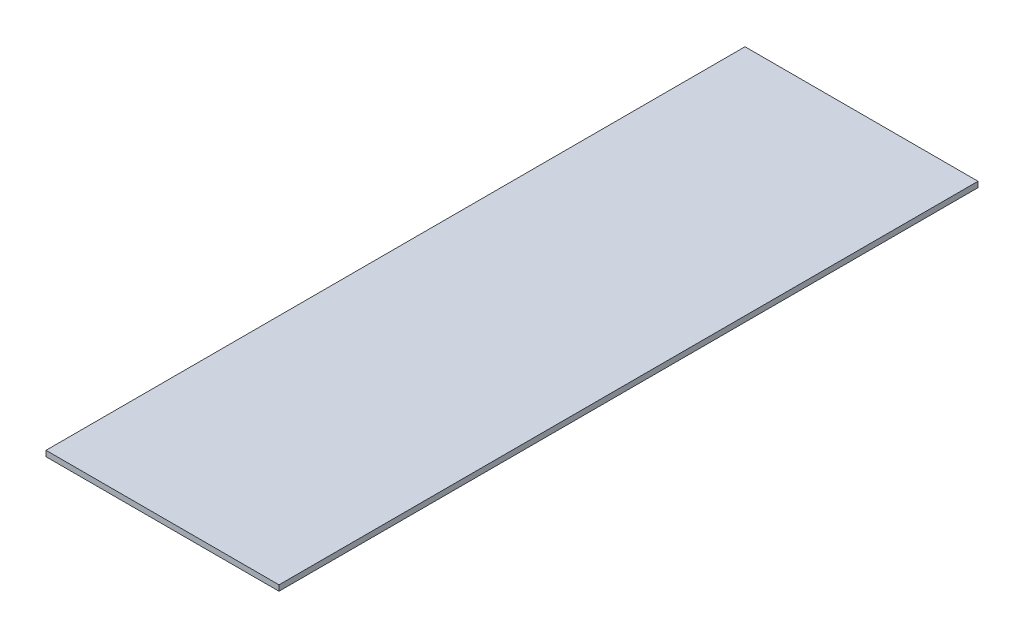
ISO-10303-21;
HEADER;
FILE_DESCRIPTION(('STEP AP214'),'2;1');
FILE_NAME('part.step','',(''),(''),'','','');
FILE_SCHEMA(('AUTOMOTIVE_DESIGN { 1 0 10303 214 1 1 1 1 }'));
ENDSEC;
DATA;
#1=APPLICATION_CONTEXT('core data for automotive mechanical design processes');
#2=APPLICATION_PROTOCOL_DEFINITION('international standard','automotive_design',2000,#1);
#3=PRODUCT_CONTEXT('',#1,'mechanical');
#4=PRODUCT('Part','Part','',(#3));
#5=PRODUCT_RELATED_PRODUCT_CATEGORY('part','',(#4));
#6=PRODUCT_DEFINITION_FORMATION('','',#4);
#7=PRODUCT_DEFINITION_CONTEXT('part definition',#1,'design');
#8=PRODUCT_DEFINITION('design','',#6,#7);
#9=PRODUCT_DEFINITION_SHAPE('','',#8);
#10=(LENGTH_UNIT() NAMED_UNIT(*) SI_UNIT(.MILLI.,.METRE.));
#11=(NAMED_UNIT(*) PLANE_ANGLE_UNIT() SI_UNIT($,.RADIAN.));
#12=(NAMED_UNIT(*) SI_UNIT($,.STERADIAN.) SOLID_ANGLE_UNIT());
#13=UNCERTAINTY_MEASURE_WITH_UNIT(LENGTH_MEASURE(1.E-05),#10,'distance_accuracy_value','');
#14=(GEOMETRIC_REPRESENTATION_CONTEXT(3) GLOBAL_UNCERTAINTY_ASSIGNED_CONTEXT((#13)) GLOBAL_UNIT_ASSIGNED_CONTEXT((#10,
#11,#12)) REPRESENTATION_CONTEXT('',''));
#15=CARTESIAN_POINT('',(0.,0.,0.));
#16=DIRECTION('',(0.,0.,1.));
#17=DIRECTION('',(1.,0.,0.));
#18=AXIS2_PLACEMENT_3D('',#15,#16,#17);
#19=CARTESIAN_POINT('',(2500.,-120.,7500.));
#20=DIRECTION('',(1.,0.,0.));
#21=DIRECTION('',(0.,0.,-1.));
#22=AXIS2_PLACEMENT_3D('',#19,#20,#21);
#23=PLANE('',#22);
#24=DIRECTION('',(0.,0.,-1.));
#25=VECTOR('',#24,1.);
#26=CARTESIAN_POINT('',(2500.,0.,7500.));
#27=LINE('',#26,#25);
#28=CARTESIAN_POINT('',(2500.,0.,7500.));
#29=VERTEX_POINT('',#28);
#30=CARTESIAN_POINT('',(2500.,0.,-7500.));
#31=VERTEX_POINT('',#30);
#32=EDGE_CURVE('E99',#29,#31,#27,.T.);
#33=ORIENTED_EDGE('',*,*,#32,.F.);
#34=DIRECTION('',(0.,1.,0.));
#35=VECTOR('',#34,1.);
#36=CARTESIAN_POINT('',(2500.,-120.,7500.));
#37=LINE('',#36,#35);
#38=CARTESIAN_POINT('',(2500.,-120.,7500.));
#39=VERTEX_POINT('',#38);
#40=EDGE_CURVE('E11',#39,#29,#37,.T.);
#41=ORIENTED_EDGE('',*,*,#40,.F.);
#42=DIRECTION('',(0.,0.,-1.));
#43=VECTOR('',#42,1.);
#44=CARTESIAN_POINT('',(2500.,-120.,7500.));
#45=LINE('',#44,#43);
#46=CARTESIAN_POINT('',(2500.,-120.,-7500.));
#47=VERTEX_POINT('',#46);
#48=EDGE_CURVE('E93',#39,#47,#45,.T.);
#49=ORIENTED_EDGE('',*,*,#48,.T.);
#50=DIRECTION('',(0.,1.,0.));
#51=VECTOR('',#50,1.);
#52=CARTESIAN_POINT('',(2500.,-120.,-7500.));
#53=LINE('',#52,#51);
#54=EDGE_CURVE('E38',#47,#31,#53,.T.);
#55=ORIENTED_EDGE('',*,*,#54,.T.);
#56=EDGE_LOOP('',(#33,#41,#49,#55));
#57=FACE_BOUND('',#56,.T.);
#58=ADVANCED_FACE('F35',(#57),#23,.T.);
#59=CARTESIAN_POINT('',(2500.,-120.,7500.));
#60=DIRECTION('',(0.,0.,1.));
#61=DIRECTION('',(1.,0.,0.));
#62=AXIS2_PLACEMENT_3D('',#59,#60,#61);
#63=PLANE('',#62);
#64=DIRECTION('',(1.,0.,0.));
#65=VECTOR('',#64,1.);
#66=CARTESIAN_POINT('',(2500.,0.,7500.));
#67=LINE('',#66,#65);
#68=CARTESIAN_POINT('',(-2500.,0.,7500.));
#69=VERTEX_POINT('',#68);
#70=EDGE_CURVE('E95',#69,#29,#67,.T.);
#71=ORIENTED_EDGE('',*,*,#70,.F.);
#72=DIRECTION('',(0.,1.,0.));
#73=VECTOR('',#72,1.);
#74=CARTESIAN_POINT('',(-2500.,-120.,7500.));
#75=LINE('',#74,#73);
#76=CARTESIAN_POINT('',(-2500.,-120.,7500.));
#77=VERTEX_POINT('',#76);
#78=EDGE_CURVE('E44',#77,#69,#75,.T.);
#79=ORIENTED_EDGE('',*,*,#78,.F.);
#80=DIRECTION('',(1.,0.,0.));
#81=VECTOR('',#80,1.);
#82=CARTESIAN_POINT('',(2500.,-120.,7500.));
#83=LINE('',#82,#81);
#84=EDGE_CURVE('E90',#77,#39,#83,.T.);
#85=ORIENTED_EDGE('',*,*,#84,.T.);
#86=ORIENTED_EDGE('',*,*,#40,.T.);
#87=EDGE_LOOP('',(#71,#79,#85,#86));
#88=FACE_BOUND('',#87,.T.);
#89=ADVANCED_FACE('F109',(#88),#63,.T.);
#90=CARTESIAN_POINT('',(-2500.,-120.,7500.));
#91=DIRECTION('',(-1.,0.,0.));
#92=DIRECTION('',(0.,0.,1.));
#93=AXIS2_PLACEMENT_3D('',#90,#91,#92);
#94=PLANE('',#93);
#95=DIRECTION('',(0.,0.,1.));
#96=VECTOR('',#95,1.);
#97=CARTESIAN_POINT('',(-2500.,0.,7500.));
#98=LINE('',#97,#96);
#99=CARTESIAN_POINT('',(-2500.,0.,-7500.));
#100=VERTEX_POINT('',#99);
#101=EDGE_CURVE('E85',#100,#69,#98,.T.);
#102=ORIENTED_EDGE('',*,*,#101,.F.);
#103=DIRECTION('',(0.,1.,0.));
#104=VECTOR('',#103,1.);
#105=CARTESIAN_POINT('',(-2500.,-120.,-7500.));
#106=LINE('',#105,#104);
#107=CARTESIAN_POINT('',(-2500.,-120.,-7500.));
#108=VERTEX_POINT('',#107);
#109=EDGE_CURVE('E80',#108,#100,#106,.T.);
#110=ORIENTED_EDGE('',*,*,#109,.F.);
#111=DIRECTION('',(0.,0.,1.));
#112=VECTOR('',#111,1.);
#113=CARTESIAN_POINT('',(-2500.,-120.,7500.));
#114=LINE('',#113,#112);
#115=EDGE_CURVE('E83',#108,#77,#114,.T.);
#116=ORIENTED_EDGE('',*,*,#115,.T.);
#117=ORIENTED_EDGE('',*,*,#78,.T.);
#118=EDGE_LOOP('',(#102,#110,#116,#117));
#119=FACE_BOUND('',#118,.T.);
#120=ADVANCED_FACE('F82',(#119),#94,.T.);
#121=CARTESIAN_POINT('',(2500.,-120.,-7500.));
#122=DIRECTION('',(0.,0.,-1.));
#123=DIRECTION('',(-1.,0.,0.));
#124=AXIS2_PLACEMENT_3D('',#121,#122,#123);
#125=PLANE('',#124);
#126=DIRECTION('',(-1.,0.,0.));
#127=VECTOR('',#126,1.);
#128=CARTESIAN_POINT('',(2500.,0.,-7500.));
#129=LINE('',#128,#127);
#130=EDGE_CURVE('E102',#31,#100,#129,.T.);
#131=ORIENTED_EDGE('',*,*,#130,.F.);
#132=ORIENTED_EDGE('',*,*,#54,.F.);
#133=DIRECTION('',(-1.,0.,0.));
#134=VECTOR('',#133,1.);
#135=CARTESIAN_POINT('',(2500.,-120.,-7500.));
#136=LINE('',#135,#134);
#137=EDGE_CURVE('E89',#47,#108,#136,.T.);
#138=ORIENTED_EDGE('',*,*,#137,.T.);
#139=ORIENTED_EDGE('',*,*,#109,.T.);
#140=EDGE_LOOP('',(#131,#132,#138,#139));
#141=FACE_BOUND('',#140,.T.);
#142=ADVANCED_FACE('F92',(#141),#125,.T.);
#143=CARTESIAN_POINT('',(0.,-120.,0.));
#144=DIRECTION('',(0.,1.,0.));
#145=DIRECTION('',(0.,0.,1.));
#146=AXIS2_PLACEMENT_3D('',#143,#144,#145);
#147=PLANE('',#146);
#148=ORIENTED_EDGE('',*,*,#48,.F.);
#149=ORIENTED_EDGE('',*,*,#84,.F.);
#150=ORIENTED_EDGE('',*,*,#115,.F.);
#151=ORIENTED_EDGE('',*,*,#137,.F.);
#152=EDGE_LOOP('',(#148,#149,#150,#151));
#153=FACE_BOUND('',#152,.T.);
#154=ADVANCED_FACE('F88',(#153),#147,.F.);
#155=CARTESIAN_POINT('',(0.,0.,0.));
#156=DIRECTION('',(0.,1.,0.));
#157=DIRECTION('',(0.,0.,1.));
#158=AXIS2_PLACEMENT_3D('',#155,#156,#157);
#159=PLANE('',#158);
#160=ORIENTED_EDGE('',*,*,#32,.T.);
#161=ORIENTED_EDGE('',*,*,#130,.T.);
#162=ORIENTED_EDGE('',*,*,#101,.T.);
#163=ORIENTED_EDGE('',*,*,#70,.T.);
#164=EDGE_LOOP('',(#160,#161,#162,#163));
#165=FACE_BOUND('',#164,.T.);
#166=ADVANCED_FACE('F108',(#165),#159,.T.);
#167=CLOSED_SHELL('',(#58,#89,#120,#142,#154,#166));
#168=MANIFOLD_SOLID_BREP('B2',#167);
#169=ADVANCED_BREP_SHAPE_REPRESENTATION('',(#18,#168),#14);
#170=SHAPE_DEFINITION_REPRESENTATION(#9,#169);
ENDSEC;
END-ISO-10303-21;
